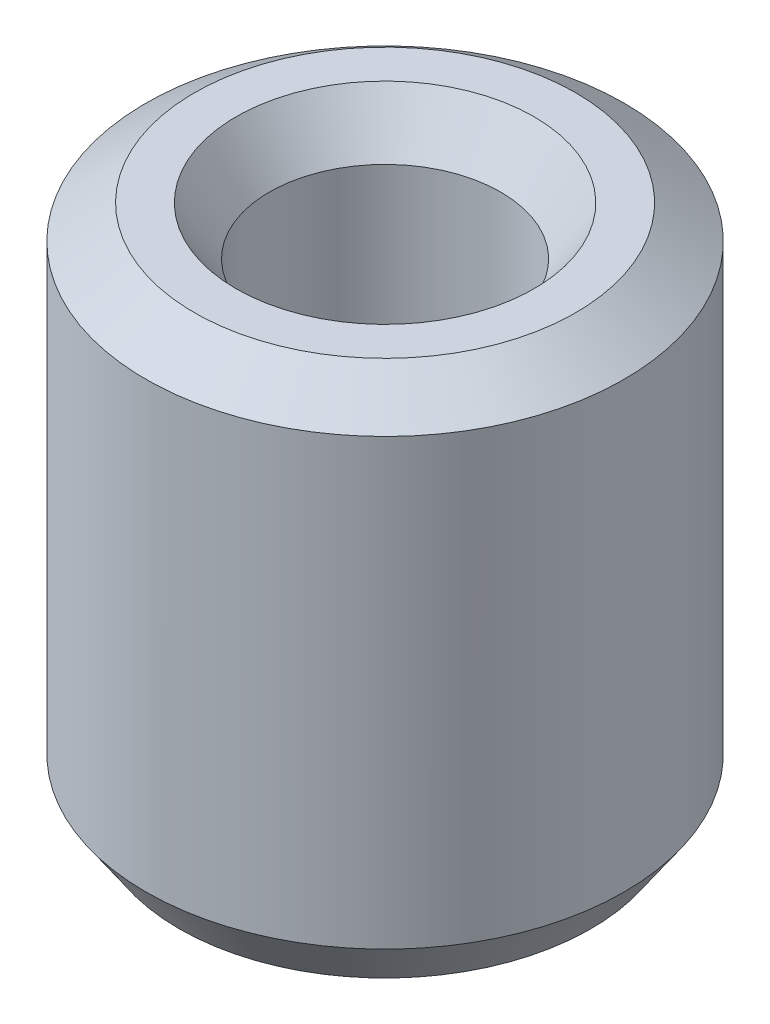
ISO-10303-21;
HEADER;
FILE_DESCRIPTION(('STEP AP214'),'2;1');
FILE_NAME('part.step','',(''),(''),'','','');
FILE_SCHEMA(('AUTOMOTIVE_DESIGN { 1 0 10303 214 1 1 1 1 }'));
ENDSEC;
DATA;
#1=APPLICATION_CONTEXT('core data for automotive mechanical design processes');
#2=APPLICATION_PROTOCOL_DEFINITION('international standard','automotive_design',2000,#1);
#3=PRODUCT_CONTEXT('',#1,'mechanical');
#4=PRODUCT('Part','Part','',(#3));
#5=PRODUCT_RELATED_PRODUCT_CATEGORY('part','',(#4));
#6=PRODUCT_DEFINITION_FORMATION('','',#4);
#7=PRODUCT_DEFINITION_CONTEXT('part definition',#1,'design');
#8=PRODUCT_DEFINITION('design','',#6,#7);
#9=PRODUCT_DEFINITION_SHAPE('','',#8);
#10=(LENGTH_UNIT() NAMED_UNIT(*) SI_UNIT(.MILLI.,.METRE.));
#11=(NAMED_UNIT(*) PLANE_ANGLE_UNIT() SI_UNIT($,.RADIAN.));
#12=(NAMED_UNIT(*) SI_UNIT($,.STERADIAN.) SOLID_ANGLE_UNIT());
#13=UNCERTAINTY_MEASURE_WITH_UNIT(LENGTH_MEASURE(1.E-05),#10,'distance_accuracy_value','');
#14=(GEOMETRIC_REPRESENTATION_CONTEXT(3) GLOBAL_UNCERTAINTY_ASSIGNED_CONTEXT((#13)) GLOBAL_UNIT_ASSIGNED_CONTEXT((#10,
#11,#12)) REPRESENTATION_CONTEXT('',''));
#15=CARTESIAN_POINT('',(0.,0.,0.));
#16=DIRECTION('',(0.,0.,1.));
#17=DIRECTION('',(1.,0.,0.));
#18=AXIS2_PLACEMENT_3D('',#15,#16,#17);
#19=CARTESIAN_POINT('',(0.,21.9879163027818,0.));
#20=DIRECTION('',(0.,-1.,0.));
#21=DIRECTION('',(0.,0.,-1.));
#22=AXIS2_PLACEMENT_3D('',#19,#20,#21);
#23=CYLINDRICAL_SURFACE('',#22,10.);
#24=CARTESIAN_POINT('',(0.,2.03140827841682,0.));
#25=DIRECTION('',(0.,1.,0.));
#26=DIRECTION('',(0.,0.,1.));
#27=AXIS2_PLACEMENT_3D('',#24,#25,#26);
#28=CIRCLE('',#27,10.);
#29=CARTESIAN_POINT('',(0.,2.03140827841682,10.));
#30=VERTEX_POINT('',#29);
#31=EDGE_CURVE('E10',#30,#30,#28,.T.);
#32=ORIENTED_EDGE('',*,*,#31,.T.);
#33=EDGE_LOOP('',(#32));
#34=FACE_BOUND('',#33,.T.);
#35=CARTESIAN_POINT('',(0.,20.5949729991889,0.));
#36=DIRECTION('',(0.,1.,0.));
#37=DIRECTION('',(0.,0.,1.));
#38=AXIS2_PLACEMENT_3D('',#35,#36,#37);
#39=CIRCLE('',#38,10.);
#40=CARTESIAN_POINT('',(0.,20.5949729991889,-10.));
#41=VERTEX_POINT('',#40);
#42=EDGE_CURVE('E50',#41,#41,#39,.F.);
#43=ORIENTED_EDGE('',*,*,#42,.T.);
#44=EDGE_LOOP('',(#43));
#45=FACE_BOUND('',#44,.T.);
#46=ADVANCED_FACE('F39',(#34,#45),#23,.T.);
#47=CARTESIAN_POINT('',(0.,21.9879163027818,0.));
#48=DIRECTION('',(0.,1.,0.));
#49=DIRECTION('',(0.,0.,1.));
#50=AXIS2_PLACEMENT_3D('',#47,#48,#49);
#51=PLANE('',#50);
#52=CARTESIAN_POINT('',(0.,21.9879163027818,0.));
#53=DIRECTION('',(0.,1.,0.));
#54=DIRECTION('',(0.,0.,1.));
#55=AXIS2_PLACEMENT_3D('',#52,#53,#54);
#56=CIRCLE('',#55,6.23024136675493);
#57=CARTESIAN_POINT('',(0.,21.9879163027818,6.23024136675493));
#58=VERTEX_POINT('',#57);
#59=EDGE_CURVE('E58',#58,#58,#56,.F.);
#60=ORIENTED_EDGE('',*,*,#59,.T.);
#61=EDGE_LOOP('',(#60));
#62=FACE_BOUND('',#61,.T.);
#63=CARTESIAN_POINT('',(0.,21.9879163027818,0.));
#64=DIRECTION('',(0.,1.,0.));
#65=DIRECTION('',(0.,0.,1.));
#66=AXIS2_PLACEMENT_3D('',#63,#64,#65);
#67=CIRCLE('',#66,7.96859172158319);
#68=CARTESIAN_POINT('',(0.,21.9879163027818,-7.96859172158319));
#69=VERTEX_POINT('',#68);
#70=EDGE_CURVE('E61',#69,#69,#67,.T.);
#71=ORIENTED_EDGE('',*,*,#70,.T.);
#72=EDGE_LOOP('',(#71));
#73=FACE_BOUND('',#72,.T.);
#74=ADVANCED_FACE('F88',(#62,#73),#51,.T.);
#75=CARTESIAN_POINT('',(0.,0.,0.));
#76=DIRECTION('',(0.,1.,0.));
#77=DIRECTION('',(0.,0.,1.));
#78=AXIS2_PLACEMENT_3D('',#75,#76,#77);
#79=PLANE('',#78);
#80=CARTESIAN_POINT('',(0.,0.,0.));
#81=DIRECTION('',(0.,1.,0.));
#82=DIRECTION('',(0.,0.,1.));
#83=AXIS2_PLACEMENT_3D('',#80,#81,#82);
#84=CIRCLE('',#83,6.86870634157883);
#85=CARTESIAN_POINT('',(0.,0.,6.86870634157883));
#86=VERTEX_POINT('',#85);
#87=EDGE_CURVE('E51',#86,#86,#84,.T.);
#88=ORIENTED_EDGE('',*,*,#87,.T.);
#89=EDGE_LOOP('',(#88));
#90=FACE_BOUND('',#89,.T.);
#91=CARTESIAN_POINT('',(0.,0.,0.));
#92=DIRECTION('',(0.,1.,0.));
#93=DIRECTION('',(0.,0.,1.));
#94=AXIS2_PLACEMENT_3D('',#91,#92,#93);
#95=CIRCLE('',#94,8.60705669640709);
#96=CARTESIAN_POINT('',(0.,0.,8.60705669640709));
#97=VERTEX_POINT('',#96);
#98=EDGE_CURVE('E54',#97,#97,#95,.F.);
#99=ORIENTED_EDGE('',*,*,#98,.T.);
#100=EDGE_LOOP('',(#99));
#101=FACE_BOUND('',#100,.T.);
#102=ADVANCED_FACE('F83',(#90,#101),#79,.F.);
#103=CARTESIAN_POINT('',(0.,21.9879163027818,0.));
#104=DIRECTION('',(0.,-1.,0.));
#105=DIRECTION('',(0.,0.,-1.));
#106=AXIS2_PLACEMENT_3D('',#103,#104,#105);
#107=CYLINDRICAL_SURFACE('',#106,4.83729806316202);
#108=CARTESIAN_POINT('',(0.,19.956508024365,0.));
#109=DIRECTION('',(0.,1.,0.));
#110=DIRECTION('',(0.,0.,1.));
#111=AXIS2_PLACEMENT_3D('',#108,#109,#110);
#112=CIRCLE('',#111,4.83729806316202);
#113=CARTESIAN_POINT('',(0.,19.956508024365,4.83729806316202));
#114=VERTEX_POINT('',#113);
#115=EDGE_CURVE('E67',#114,#114,#112,.T.);
#116=ORIENTED_EDGE('',*,*,#115,.T.);
#117=EDGE_LOOP('',(#116));
#118=FACE_BOUND('',#117,.T.);
#119=CARTESIAN_POINT('',(0.,1.3929433035929,0.));
#120=DIRECTION('',(0.,1.,0.));
#121=DIRECTION('',(0.,0.,1.));
#122=AXIS2_PLACEMENT_3D('',#119,#120,#121);
#123=CIRCLE('',#122,4.83729806316202);
#124=CARTESIAN_POINT('',(0.,1.3929433035929,4.83729806316202));
#125=VERTEX_POINT('',#124);
#126=EDGE_CURVE('E69',#125,#125,#123,.F.);
#127=ORIENTED_EDGE('',*,*,#126,.T.);
#128=EDGE_LOOP('',(#127));
#129=FACE_BOUND('',#128,.T.);
#130=ADVANCED_FACE('F71',(#118,#129),#107,.F.);
#131=CARTESIAN_POINT('',(0.,19.956508024365,0.));
#132=DIRECTION('',(0.,1.,0.));
#133=DIRECTION('',(0.,0.,1.));
#134=AXIS2_PLACEMENT_3D('',#131,#132,#133);
#135=CONICAL_SURFACE('',#134,4.83729806316202,0.601066263281989);
#136=ORIENTED_EDGE('',*,*,#59,.F.);
#137=EDGE_LOOP('',(#136));
#138=FACE_BOUND('',#137,.T.);
#139=ORIENTED_EDGE('',*,*,#115,.F.);
#140=EDGE_LOOP('',(#139));
#141=FACE_BOUND('',#140,.T.);
#142=ADVANCED_FACE('F77',(#138,#141),#135,.F.);
#143=CARTESIAN_POINT('',(0.,0.,0.));
#144=DIRECTION('',(0.,-1.,0.));
#145=DIRECTION('',(0.,0.,-1.));
#146=AXIS2_PLACEMENT_3D('',#143,#144,#145);
#147=CONICAL_SURFACE('',#146,6.86870634157883,0.969730063512907);
#148=ORIENTED_EDGE('',*,*,#126,.F.);
#149=EDGE_LOOP('',(#148));
#150=FACE_BOUND('',#149,.T.);
#151=ORIENTED_EDGE('',*,*,#87,.F.);
#152=EDGE_LOOP('',(#151));
#153=FACE_BOUND('',#152,.T.);
#154=ADVANCED_FACE('F73',(#150,#153),#147,.F.);
#155=CARTESIAN_POINT('',(0.,2.03140827841682,0.));
#156=DIRECTION('',(0.,1.,0.));
#157=DIRECTION('',(0.,0.,1.));
#158=AXIS2_PLACEMENT_3D('',#155,#156,#157);
#159=CONICAL_SURFACE('',#158,10.,0.60106626328199);
#160=ORIENTED_EDGE('',*,*,#98,.F.);
#161=EDGE_LOOP('',(#160));
#162=FACE_BOUND('',#161,.T.);
#163=ORIENTED_EDGE('',*,*,#31,.F.);
#164=EDGE_LOOP('',(#163));
#165=FACE_BOUND('',#164,.T.);
#166=ADVANCED_FACE('F76',(#162,#165),#159,.T.);
#167=CARTESIAN_POINT('',(0.,21.9879163027818,0.));
#168=DIRECTION('',(0.,-1.,0.));
#169=DIRECTION('',(0.,0.,-1.));
#170=AXIS2_PLACEMENT_3D('',#167,#168,#169);
#171=CONICAL_SURFACE('',#170,7.96859172158319,0.969730063512906);
#172=CARTESIAN_POINT('',(0.,20.5949729991889,-10.));
#173=CARTESIAN_POINT('',(0.,20.609482825268,-9.97883949709983));
#174=CARTESIAN_POINT('',(0.,20.6239926513471,-9.95767899419965));
#175=CARTESIAN_POINT('',(0.,20.6530123035053,-9.9153579883993));
#176=CARTESIAN_POINT('',(0.,20.6675221295844,-9.89419748549913));
#177=CARTESIAN_POINT('',(0.,20.6965417817426,-9.85187647969878));
#178=CARTESIAN_POINT('',(0.,20.7110516078217,-9.8307159767986));
#179=CARTESIAN_POINT('',(0.,20.7400712599798,-9.78839497099825));
#180=CARTESIAN_POINT('',(0.,20.7545810860589,-9.76723446809808));
#181=CARTESIAN_POINT('',(0.,20.7836007382171,-9.72491346229773));
#182=CARTESIAN_POINT('',(0.,20.7981105642962,-9.70375295939755));
#183=CARTESIAN_POINT('',(0.,20.8271302164544,-9.6614319535972));
#184=CARTESIAN_POINT('',(0.,20.8416400425335,-9.64027145069703));
#185=CARTESIAN_POINT('',(0.,20.8706596946917,-9.59795044489668));
#186=CARTESIAN_POINT('',(0.,20.8851695207708,-9.5767899419965));
#187=CARTESIAN_POINT('',(0.,20.914189172929,-9.53446893619615));
#188=CARTESIAN_POINT('',(0.,20.928698999008,-9.51330843329598));
#189=CARTESIAN_POINT('',(0.,20.9577186511662,-9.47098742749563));
#190=CARTESIAN_POINT('',(0.,20.9722284772453,-9.44982692459545));
#191=CARTESIAN_POINT('',(0.,21.0012481294035,-9.4075059187951));
#192=CARTESIAN_POINT('',(0.,21.0157579554826,-9.38634541589493));
#193=CARTESIAN_POINT('',(0.,21.0447776076408,-9.34402441009458));
#194=CARTESIAN_POINT('',(0.,21.0592874337199,-9.3228639071944));
#195=CARTESIAN_POINT('',(0.,21.0883070858781,-9.28054290139405));
#196=CARTESIAN_POINT('',(0.,21.1028169119572,-9.25938239849387));
#197=CARTESIAN_POINT('',(0.,21.1318365641153,-9.21706139269352));
#198=CARTESIAN_POINT('',(0.,21.1463463901944,-9.19590088979335));
#199=CARTESIAN_POINT('',(0.,21.1753660423526,-9.153579883993));
#200=CARTESIAN_POINT('',(0.,21.1898758684317,-9.13241938109282));
#201=CARTESIAN_POINT('',(0.,21.2188955205899,-9.09009837529247));
#202=CARTESIAN_POINT('',(0.,21.233405346669,-9.0689378723923));
#203=CARTESIAN_POINT('',(0.,21.2624249988272,-9.02661686659195));
#204=CARTESIAN_POINT('',(0.,21.2769348249063,-9.00545636369177));
#205=CARTESIAN_POINT('',(0.,21.3059544770645,-8.96313535789142));
#206=CARTESIAN_POINT('',(0.,21.3204643031436,-8.94197485499125));
#207=CARTESIAN_POINT('',(0.,21.3494839553017,-8.89965384919089));
#208=CARTESIAN_POINT('',(0.,21.3639937813808,-8.87849334629072));
#209=CARTESIAN_POINT('',(0.,21.393013433539,-8.83617234049037));
#210=CARTESIAN_POINT('',(0.,21.4075232596181,-8.8150118375902));
#211=CARTESIAN_POINT('',(0.,21.4365429117763,-8.77269083178984));
#212=CARTESIAN_POINT('',(0.,21.4510527378554,-8.75153032888967));
#213=CARTESIAN_POINT('',(0.,21.4800723900136,-8.70920932308932));
#214=CARTESIAN_POINT('',(0.,21.4945822160927,-8.68804882018914));
#215=CARTESIAN_POINT('',(0.,21.5236018682509,-8.64572781438879));
#216=CARTESIAN_POINT('',(0.,21.5381116943299,-8.62456731148862));
#217=CARTESIAN_POINT('',(0.,21.5671313464881,-8.58224630568827));
#218=CARTESIAN_POINT('',(0.,21.5816411725672,-8.56108580278809));
#219=CARTESIAN_POINT('',(0.,21.6106608247254,-8.51876479698774));
#220=CARTESIAN_POINT('',(0.,21.6251706508045,-8.49760429408757));
#221=CARTESIAN_POINT('',(0.,21.6541903029627,-8.45528328828722));
#222=CARTESIAN_POINT('',(0.,21.6687001290418,-8.43412278538704));
#223=CARTESIAN_POINT('',(0.,21.6977197812,-8.39180177958669));
#224=CARTESIAN_POINT('',(0.,21.7122296072791,-8.37064127668652));
#225=CARTESIAN_POINT('',(0.,21.7412492594372,-8.32832027088617));
#226=CARTESIAN_POINT('',(0.,21.7557590855163,-8.30715976798599));
#227=CARTESIAN_POINT('',(0.,21.7847787376745,-8.26483876218564));
#228=CARTESIAN_POINT('',(0.,21.7992885637536,-8.24367825928547));
#229=CARTESIAN_POINT('',(0.,21.8283082159118,-8.20135725348511));
#230=CARTESIAN_POINT('',(0.,21.8428180419909,-8.18019675058494));
#231=CARTESIAN_POINT('',(0.,21.8718376941491,-8.13787574478459));
#232=CARTESIAN_POINT('',(0.,21.8863475202282,-8.11671524188442));
#233=CARTESIAN_POINT('',(0.,21.9153671723864,-8.07439423608406));
#234=CARTESIAN_POINT('',(0.,21.9298769984655,-8.05323373318389));
#235=CARTESIAN_POINT('',(0.,21.9588966506236,-8.01091272738354));
#236=CARTESIAN_POINT('',(0.,21.9734064767027,-7.98975222448336));
#237=CARTESIAN_POINT('',(0.,21.9879163027818,-7.96859172158319));
#238=B_SPLINE_CURVE_WITH_KNOTS('',3,(#172,#173,#174,#175,#176,#177,#178,#179,#180,#181,#182,
#183,#184,#185,#186,#187,#188,#189,#190,#191,#192,#193,#194,#195,#196,#197,#198,#199,#200,#201,
#202,#203,#204,#205,#206,#207,#208,#209,#210,#211,#212,#213,#214,#215,#216,#217,#218,#219,#220,
#221,#222,#223,#224,#225,#226,#227,#228,#229,#230,#231,#232,#233,#234,#235,#236,#237),
.UNSPECIFIED.,.F.,.F.,(4,2,2,2,2,2,2,2,2,2,2,2,2,2,2,2,2,2,2,2,2,2,2,2,2,2,2,2,2,2,2,2,4),(0.,
0.0769721860317407,0.153944372063478,0.230916558095217,0.307888744126957,0.384860930158694,
0.461833116190435,0.538805302222172,0.615777488253911,0.69274967428565,0.769721860317389,
0.846694046349127,0.923666232380866,1.0006384184126,1.07761060444434,1.15458279047608,
1.23155497650782,1.30852716253956,1.3854993485713,1.46247153460304,1.53944372063478,
1.61641590666652,1.69338809269825,1.77036027872999,1.84733246476173,1.92430465079347,
2.00127683682521,2.07824902285695,2.15522120888869,2.23219339492043,2.30916558095216,
2.3861377669839,2.46310995301564),.UNSPECIFIED.);
#239=EDGE_CURVE('BSEAM45',#41,#69,#238,.T.);
#240=ORIENTED_EDGE('',*,*,#42,.F.);
#241=ORIENTED_EDGE('',*,*,#70,.F.);
#242=ORIENTED_EDGE('',*,*,#239,.T.);
#243=ORIENTED_EDGE('',*,*,#239,.F.);
#244=EDGE_LOOP('',(#240,#242,#241,#243));
#245=FACE_BOUND('',#244,.T.);
#246=ADVANCED_FACE('F45',(#245),#171,.T.);
#247=CLOSED_SHELL('',(#46,#74,#102,#130,#142,#154,#166,#246));
#248=MANIFOLD_SOLID_BREP('B2',#247);
#249=ADVANCED_BREP_SHAPE_REPRESENTATION('',(#18,#248),#14);
#250=SHAPE_DEFINITION_REPRESENTATION(#9,#249);
ENDSEC;
END-ISO-10303-21;
